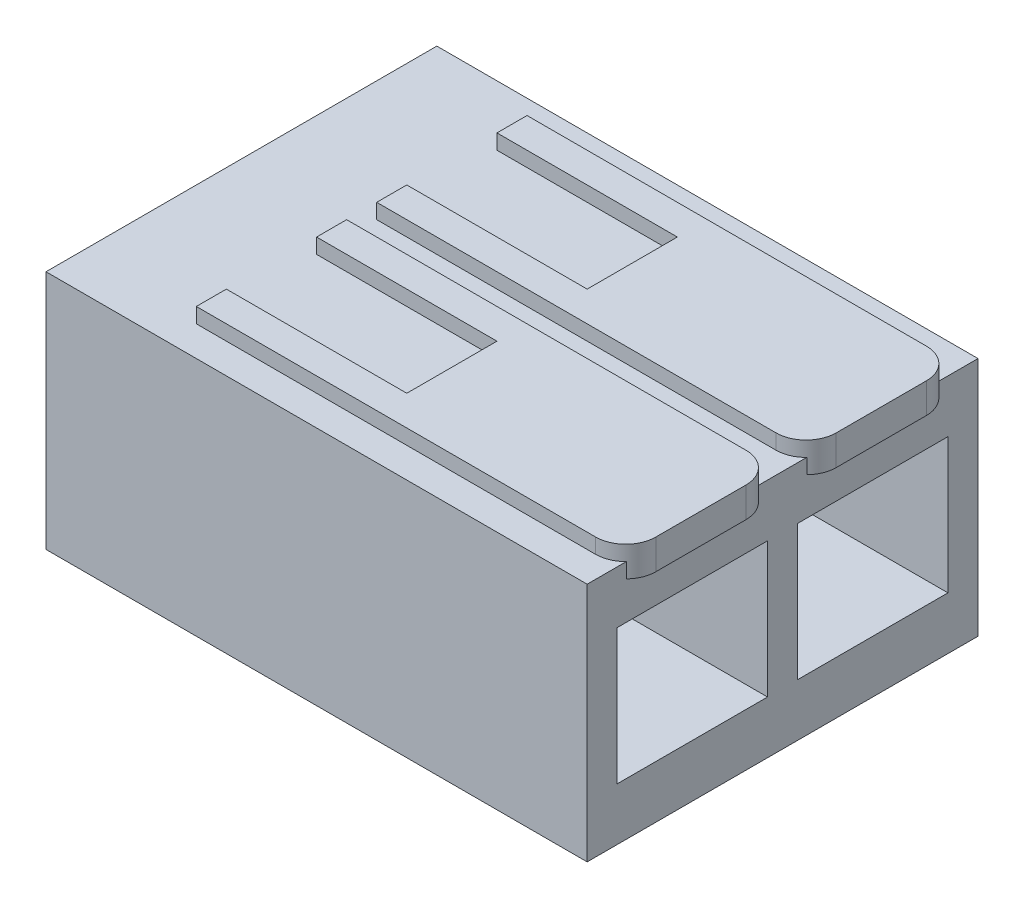
ISO-10303-21;
HEADER;
FILE_DESCRIPTION(('STEP AP214'),'2;1');
FILE_NAME('part.step','',(''),(''),'','','');
FILE_SCHEMA(('AUTOMOTIVE_DESIGN { 1 0 10303 214 1 1 1 1 }'));
ENDSEC;
DATA;
#1=APPLICATION_CONTEXT('core data for automotive mechanical design processes');
#2=APPLICATION_PROTOCOL_DEFINITION('international standard','automotive_design',2000,#1);
#3=PRODUCT_CONTEXT('',#1,'mechanical');
#4=PRODUCT('Part','Part','',(#3));
#5=PRODUCT_RELATED_PRODUCT_CATEGORY('part','',(#4));
#6=PRODUCT_DEFINITION_FORMATION('','',#4);
#7=PRODUCT_DEFINITION_CONTEXT('part definition',#1,'design');
#8=PRODUCT_DEFINITION('design','',#6,#7);
#9=PRODUCT_DEFINITION_SHAPE('','',#8);
#10=(LENGTH_UNIT() NAMED_UNIT(*) SI_UNIT(.MILLI.,.METRE.));
#11=(NAMED_UNIT(*) PLANE_ANGLE_UNIT() SI_UNIT($,.RADIAN.));
#12=(NAMED_UNIT(*) SI_UNIT($,.STERADIAN.) SOLID_ANGLE_UNIT());
#13=UNCERTAINTY_MEASURE_WITH_UNIT(LENGTH_MEASURE(1.E-05),#10,'distance_accuracy_value','');
#14=(GEOMETRIC_REPRESENTATION_CONTEXT(3) GLOBAL_UNCERTAINTY_ASSIGNED_CONTEXT((#13)) GLOBAL_UNIT_ASSIGNED_CONTEXT((#10,
#11,#12)) REPRESENTATION_CONTEXT('',''));
#15=CARTESIAN_POINT('',(0.,0.,0.));
#16=DIRECTION('',(0.,0.,1.));
#17=DIRECTION('',(1.,0.,0.));
#18=AXIS2_PLACEMENT_3D('',#15,#16,#17);
#19=CARTESIAN_POINT('',(4.,8.5,7.));
#20=DIRECTION('',(1.,0.,0.));
#21=DIRECTION('',(0.,1.,0.));
#22=AXIS2_PLACEMENT_3D('',#19,#20,#21);
#23=PLANE('',#22);
#24=DIRECTION('',(0.,0.,1.));
#25=VECTOR('',#24,1.);
#26=CARTESIAN_POINT('',(4.,7.5,7.));
#27=LINE('',#26,#25);
#28=CARTESIAN_POINT('',(4.,7.5,7.));
#29=VERTEX_POINT('',#28);
#30=CARTESIAN_POINT('',(4.,7.5,8.));
#31=VERTEX_POINT('',#30);
#32=EDGE_CURVE('E157',#29,#31,#27,.T.);
#33=ORIENTED_EDGE('',*,*,#32,.T.);
#34=DIRECTION('',(0.,-1.,0.));
#35=VECTOR('',#34,1.);
#36=CARTESIAN_POINT('',(4.,8.5,8.));
#37=LINE('',#36,#35);
#38=CARTESIAN_POINT('',(4.,8.5,8.));
#39=VERTEX_POINT('',#38);
#40=EDGE_CURVE('E12',#39,#31,#37,.T.);
#41=ORIENTED_EDGE('',*,*,#40,.F.);
#42=DIRECTION('',(0.,0.,1.));
#43=VECTOR('',#42,1.);
#44=CARTESIAN_POINT('',(4.,8.5,7.));
#45=LINE('',#44,#43);
#46=CARTESIAN_POINT('',(4.,8.5,7.));
#47=VERTEX_POINT('',#46);
#48=EDGE_CURVE('E175',#47,#39,#45,.T.);
#49=ORIENTED_EDGE('',*,*,#48,.F.);
#50=DIRECTION('',(0.,-1.,0.));
#51=VECTOR('',#50,1.);
#52=CARTESIAN_POINT('',(4.,8.5,7.));
#53=LINE('',#52,#51);
#54=EDGE_CURVE('E153',#47,#29,#53,.T.);
#55=ORIENTED_EDGE('',*,*,#54,.T.);
#56=EDGE_LOOP('',(#33,#41,#49,#55));
#57=FACE_BOUND('',#56,.T.);
#58=ADVANCED_FACE('F49',(#57),#23,.F.);
#59=CARTESIAN_POINT('',(4.,8.5,8.));
#60=DIRECTION('',(0.,0.,-1.));
#61=DIRECTION('',(-1.,0.,0.));
#62=AXIS2_PLACEMENT_3D('',#59,#60,#61);
#63=PLANE('',#62);
#64=DIRECTION('',(1.,0.,0.));
#65=VECTOR('',#64,1.);
#66=CARTESIAN_POINT('',(4.,7.5,8.));
#67=LINE('',#66,#65);
#68=CARTESIAN_POINT('',(10.,7.5,8.));
#69=VERTEX_POINT('',#68);
#70=EDGE_CURVE('E160',#31,#69,#67,.T.);
#71=ORIENTED_EDGE('',*,*,#70,.T.);
#72=DIRECTION('',(0.,-1.,0.));
#73=VECTOR('',#72,1.);
#74=CARTESIAN_POINT('',(10.,8.5,8.));
#75=LINE('',#74,#73);
#76=CARTESIAN_POINT('',(10.,8.5,8.));
#77=VERTEX_POINT('',#76);
#78=EDGE_CURVE('E57',#77,#69,#75,.T.);
#79=ORIENTED_EDGE('',*,*,#78,.F.);
#80=DIRECTION('',(1.,0.,0.));
#81=VECTOR('',#80,1.);
#82=CARTESIAN_POINT('',(4.,8.5,8.));
#83=LINE('',#82,#81);
#84=EDGE_CURVE('E114',#39,#77,#83,.T.);
#85=ORIENTED_EDGE('',*,*,#84,.F.);
#86=ORIENTED_EDGE('',*,*,#40,.T.);
#87=EDGE_LOOP('',(#71,#79,#85,#86));
#88=FACE_BOUND('',#87,.T.);
#89=ADVANCED_FACE('F224',(#88),#63,.F.);
#90=CARTESIAN_POINT('',(10.,8.5,8.));
#91=DIRECTION('',(1.,0.,0.));
#92=DIRECTION('',(0.,1.,0.));
#93=AXIS2_PLACEMENT_3D('',#90,#91,#92);
#94=PLANE('',#93);
#95=DIRECTION('',(0.,0.,1.));
#96=VECTOR('',#95,1.);
#97=CARTESIAN_POINT('',(10.,7.5,8.));
#98=LINE('',#97,#96);
#99=CARTESIAN_POINT('',(10.,7.5,11.));
#100=VERTEX_POINT('',#99);
#101=EDGE_CURVE('E162',#69,#100,#98,.T.);
#102=ORIENTED_EDGE('',*,*,#101,.T.);
#103=DIRECTION('',(0.,-1.,0.));
#104=VECTOR('',#103,1.);
#105=CARTESIAN_POINT('',(10.,8.5,11.));
#106=LINE('',#105,#104);
#107=CARTESIAN_POINT('',(10.,8.5,11.));
#108=VERTEX_POINT('',#107);
#109=EDGE_CURVE('E188',#108,#100,#106,.T.);
#110=ORIENTED_EDGE('',*,*,#109,.F.);
#111=DIRECTION('',(0.,0.,1.));
#112=VECTOR('',#111,1.);
#113=CARTESIAN_POINT('',(10.,8.5,8.));
#114=LINE('',#113,#112);
#115=EDGE_CURVE('E196',#77,#108,#114,.T.);
#116=ORIENTED_EDGE('',*,*,#115,.F.);
#117=ORIENTED_EDGE('',*,*,#78,.T.);
#118=EDGE_LOOP('',(#102,#110,#116,#117));
#119=FACE_BOUND('',#118,.T.);
#120=ADVANCED_FACE('F194',(#119),#94,.F.);
#121=CARTESIAN_POINT('',(10.,8.5,11.));
#122=DIRECTION('',(0.,0.,1.));
#123=DIRECTION('',(1.,0.,0.));
#124=AXIS2_PLACEMENT_3D('',#121,#122,#123);
#125=PLANE('',#124);
#126=DIRECTION('',(-1.,0.,0.));
#127=VECTOR('',#126,1.);
#128=CARTESIAN_POINT('',(10.,7.5,11.));
#129=LINE('',#128,#127);
#130=CARTESIAN_POINT('',(4.,7.5,11.));
#131=VERTEX_POINT('',#130);
#132=EDGE_CURVE('E164',#100,#131,#129,.T.);
#133=ORIENTED_EDGE('',*,*,#132,.T.);
#134=DIRECTION('',(0.,-1.,0.));
#135=VECTOR('',#134,1.);
#136=CARTESIAN_POINT('',(4.,8.5,11.));
#137=LINE('',#136,#135);
#138=CARTESIAN_POINT('',(4.,8.5,11.));
#139=VERTEX_POINT('',#138);
#140=EDGE_CURVE('E185',#139,#131,#137,.T.);
#141=ORIENTED_EDGE('',*,*,#140,.F.);
#142=DIRECTION('',(-1.,0.,0.));
#143=VECTOR('',#142,1.);
#144=CARTESIAN_POINT('',(10.,8.5,11.));
#145=LINE('',#144,#143);
#146=EDGE_CURVE('E214',#108,#139,#145,.T.);
#147=ORIENTED_EDGE('',*,*,#146,.F.);
#148=ORIENTED_EDGE('',*,*,#109,.T.);
#149=EDGE_LOOP('',(#133,#141,#147,#148));
#150=FACE_BOUND('',#149,.T.);
#151=ADVANCED_FACE('F205',(#150),#125,.F.);
#152=CARTESIAN_POINT('',(4.,8.5,11.));
#153=DIRECTION('',(1.,0.,0.));
#154=DIRECTION('',(0.,1.,0.));
#155=AXIS2_PLACEMENT_3D('',#152,#153,#154);
#156=PLANE('',#155);
#157=DIRECTION('',(0.,0.,1.));
#158=VECTOR('',#157,1.);
#159=CARTESIAN_POINT('',(4.,7.5,11.));
#160=LINE('',#159,#158);
#161=CARTESIAN_POINT('',(4.,7.5,12.));
#162=VERTEX_POINT('',#161);
#163=EDGE_CURVE('E166',#131,#162,#160,.T.);
#164=ORIENTED_EDGE('',*,*,#163,.T.);
#165=DIRECTION('',(0.,-1.,0.));
#166=VECTOR('',#165,1.);
#167=CARTESIAN_POINT('',(4.,8.5,12.));
#168=LINE('',#167,#166);
#169=CARTESIAN_POINT('',(4.,8.5,12.));
#170=VERTEX_POINT('',#169);
#171=EDGE_CURVE('E182',#170,#162,#168,.T.);
#172=ORIENTED_EDGE('',*,*,#171,.F.);
#173=DIRECTION('',(0.,0.,1.));
#174=VECTOR('',#173,1.);
#175=CARTESIAN_POINT('',(4.,8.5,11.));
#176=LINE('',#175,#174);
#177=EDGE_CURVE('E211',#139,#170,#176,.T.);
#178=ORIENTED_EDGE('',*,*,#177,.F.);
#179=ORIENTED_EDGE('',*,*,#140,.T.);
#180=EDGE_LOOP('',(#164,#172,#178,#179));
#181=FACE_BOUND('',#180,.T.);
#182=ADVANCED_FACE('F209',(#181),#156,.F.);
#183=CARTESIAN_POINT('',(4.,8.5,12.));
#184=DIRECTION('',(0.,0.,-1.));
#185=DIRECTION('',(-1.,0.,0.));
#186=AXIS2_PLACEMENT_3D('',#183,#184,#185);
#187=PLANE('',#186);
#188=DIRECTION('',(1.,0.,0.));
#189=VECTOR('',#188,1.);
#190=CARTESIAN_POINT('',(4.,7.5,12.));
#191=LINE('',#190,#189);
#192=CARTESIAN_POINT('',(17.2832005913522,7.5,12.));
#193=VERTEX_POINT('',#192);
#194=EDGE_CURVE('E168',#162,#193,#191,.T.);
#195=ORIENTED_EDGE('',*,*,#194,.T.);
#196=DIRECTION('',(0.,-1.,0.));
#197=VECTOR('',#196,1.);
#198=CARTESIAN_POINT('',(17.2832005913522,8.5,12.));
#199=LINE('',#198,#197);
#200=CARTESIAN_POINT('',(17.2832005913522,8.5,12.));
#201=VERTEX_POINT('',#200);
#202=EDGE_CURVE('E179',#201,#193,#199,.T.);
#203=ORIENTED_EDGE('',*,*,#202,.F.);
#204=DIRECTION('',(1.,0.,0.));
#205=VECTOR('',#204,1.);
#206=CARTESIAN_POINT('',(4.,8.5,12.));
#207=LINE('',#206,#205);
#208=EDGE_CURVE('E213',#170,#201,#207,.T.);
#209=ORIENTED_EDGE('',*,*,#208,.F.);
#210=ORIENTED_EDGE('',*,*,#171,.T.);
#211=EDGE_LOOP('',(#195,#203,#209,#210));
#212=FACE_BOUND('',#211,.T.);
#213=ADVANCED_FACE('F236',(#212),#187,.F.);
#214=CARTESIAN_POINT('',(17.2832005913522,8.5,11.));
#215=DIRECTION('',(0.,-1.,0.));
#216=DIRECTION('',(1.,0.,0.));
#217=AXIS2_PLACEMENT_3D('',#214,#215,#216);
#218=CYLINDRICAL_SURFACE('',#217,1.);
#219=CARTESIAN_POINT('',(17.2832005913522,7.5,11.));
#220=DIRECTION('',(0.,1.,0.));
#221=DIRECTION('',(-1.,0.,0.));
#222=AXIS2_PLACEMENT_3D('',#219,#220,#221);
#223=CIRCLE('',#222,1.);
#224=CARTESIAN_POINT('',(18.2832005913522,7.5,11.));
#225=VERTEX_POINT('',#224);
#226=EDGE_CURVE('E170',#193,#225,#223,.T.);
#227=ORIENTED_EDGE('',*,*,#226,.T.);
#228=DIRECTION('',(0.,-1.,0.));
#229=VECTOR('',#228,1.);
#230=CARTESIAN_POINT('',(18.2832005913522,8.5,11.));
#231=LINE('',#230,#229);
#232=CARTESIAN_POINT('',(18.2832005913522,8.5,11.));
#233=VERTEX_POINT('',#232);
#234=EDGE_CURVE('E148',#233,#225,#231,.T.);
#235=ORIENTED_EDGE('',*,*,#234,.F.);
#236=CARTESIAN_POINT('',(17.2832005913522,8.5,11.));
#237=DIRECTION('',(0.,1.,0.));
#238=DIRECTION('',(-1.,0.,0.));
#239=AXIS2_PLACEMENT_3D('',#236,#237,#238);
#240=CIRCLE('',#239,1.);
#241=EDGE_CURVE('E139',#201,#233,#240,.T.);
#242=ORIENTED_EDGE('',*,*,#241,.F.);
#243=ORIENTED_EDGE('',*,*,#202,.T.);
#244=EDGE_LOOP('',(#227,#235,#242,#243));
#245=FACE_BOUND('',#244,.T.);
#246=ADVANCED_FACE('F239',(#245),#218,.T.);
#247=CARTESIAN_POINT('',(18.2832005913522,8.5,8.));
#248=DIRECTION('',(-1.,0.,0.));
#249=DIRECTION('',(0.,0.,1.));
#250=AXIS2_PLACEMENT_3D('',#247,#248,#249);
#251=PLANE('',#250);
#252=DIRECTION('',(0.,0.,-1.));
#253=VECTOR('',#252,1.);
#254=CARTESIAN_POINT('',(18.2832005913522,7.5,8.));
#255=LINE('',#254,#253);
#256=CARTESIAN_POINT('',(18.2832005913522,7.5,8.));
#257=VERTEX_POINT('',#256);
#258=EDGE_CURVE('E147',#225,#257,#255,.T.);
#259=ORIENTED_EDGE('',*,*,#258,.T.);
#260=DIRECTION('',(0.,-1.,0.));
#261=VECTOR('',#260,1.);
#262=CARTESIAN_POINT('',(18.2832005913522,8.5,8.));
#263=LINE('',#262,#261);
#264=CARTESIAN_POINT('',(18.2832005913522,8.5,8.));
#265=VERTEX_POINT('',#264);
#266=EDGE_CURVE('E144',#265,#257,#263,.T.);
#267=ORIENTED_EDGE('',*,*,#266,.F.);
#268=DIRECTION('',(0.,0.,-1.));
#269=VECTOR('',#268,1.);
#270=CARTESIAN_POINT('',(18.2832005913522,8.5,8.));
#271=LINE('',#270,#269);
#272=EDGE_CURVE('E133',#233,#265,#271,.T.);
#273=ORIENTED_EDGE('',*,*,#272,.F.);
#274=ORIENTED_EDGE('',*,*,#234,.T.);
#275=EDGE_LOOP('',(#259,#267,#273,#274));
#276=FACE_BOUND('',#275,.T.);
#277=ADVANCED_FACE('F145',(#276),#251,.F.);
#278=CARTESIAN_POINT('',(17.2832005913522,8.5,8.));
#279=DIRECTION('',(0.,-1.,0.));
#280=DIRECTION('',(1.,0.,0.));
#281=AXIS2_PLACEMENT_3D('',#278,#279,#280);
#282=CYLINDRICAL_SURFACE('',#281,0.999999999999999);
#283=CARTESIAN_POINT('',(17.2832005913522,7.5,8.));
#284=DIRECTION('',(0.,1.,0.));
#285=DIRECTION('',(1.,0.,0.));
#286=AXIS2_PLACEMENT_3D('',#283,#284,#285);
#287=CIRCLE('',#286,0.999999999999999);
#288=CARTESIAN_POINT('',(17.2832005913522,7.5,7.));
#289=VERTEX_POINT('',#288);
#290=EDGE_CURVE('E100',#257,#289,#287,.T.);
#291=ORIENTED_EDGE('',*,*,#290,.T.);
#292=DIRECTION('',(0.,-1.,0.));
#293=VECTOR('',#292,1.);
#294=CARTESIAN_POINT('',(17.2832005913522,8.5,7.));
#295=LINE('',#294,#293);
#296=CARTESIAN_POINT('',(17.2832005913522,8.5,7.));
#297=VERTEX_POINT('',#296);
#298=EDGE_CURVE('E149',#297,#289,#295,.T.);
#299=ORIENTED_EDGE('',*,*,#298,.F.);
#300=CARTESIAN_POINT('',(17.2832005913522,8.5,8.));
#301=DIRECTION('',(0.,1.,0.));
#302=DIRECTION('',(1.,0.,0.));
#303=AXIS2_PLACEMENT_3D('',#300,#301,#302);
#304=CIRCLE('',#303,0.999999999999999);
#305=EDGE_CURVE('E137',#265,#297,#304,.T.);
#306=ORIENTED_EDGE('',*,*,#305,.F.);
#307=ORIENTED_EDGE('',*,*,#266,.T.);
#308=EDGE_LOOP('',(#291,#299,#306,#307));
#309=FACE_BOUND('',#308,.T.);
#310=ADVANCED_FACE('F151',(#309),#282,.T.);
#311=CARTESIAN_POINT('',(4.,8.5,7.));
#312=DIRECTION('',(0.,0.,1.));
#313=DIRECTION('',(1.,0.,0.));
#314=AXIS2_PLACEMENT_3D('',#311,#312,#313);
#315=PLANE('',#314);
#316=DIRECTION('',(-1.,0.,0.));
#317=VECTOR('',#316,1.);
#318=CARTESIAN_POINT('',(4.,7.5,7.));
#319=LINE('',#318,#317);
#320=EDGE_CURVE('E106',#289,#29,#319,.T.);
#321=ORIENTED_EDGE('',*,*,#320,.T.);
#322=ORIENTED_EDGE('',*,*,#54,.F.);
#323=DIRECTION('',(-1.,0.,0.));
#324=VECTOR('',#323,1.);
#325=CARTESIAN_POINT('',(4.,8.5,7.));
#326=LINE('',#325,#324);
#327=EDGE_CURVE('E65',#297,#47,#326,.T.);
#328=ORIENTED_EDGE('',*,*,#327,.F.);
#329=ORIENTED_EDGE('',*,*,#298,.T.);
#330=EDGE_LOOP('',(#321,#322,#328,#329));
#331=FACE_BOUND('',#330,.T.);
#332=ADVANCED_FACE('F248',(#331),#315,.F.);
#333=CARTESIAN_POINT('',(17.2832005913522,8.5,11.));
#334=DIRECTION('',(0.,1.,0.));
#335=DIRECTION('',(-1.,0.,0.));
#336=AXIS2_PLACEMENT_3D('',#333,#334,#335);
#337=PLANE('',#336);
#338=ORIENTED_EDGE('',*,*,#48,.T.);
#339=ORIENTED_EDGE('',*,*,#84,.T.);
#340=ORIENTED_EDGE('',*,*,#115,.T.);
#341=ORIENTED_EDGE('',*,*,#146,.T.);
#342=ORIENTED_EDGE('',*,*,#177,.T.);
#343=ORIENTED_EDGE('',*,*,#208,.T.);
#344=ORIENTED_EDGE('',*,*,#241,.T.);
#345=ORIENTED_EDGE('',*,*,#272,.T.);
#346=ORIENTED_EDGE('',*,*,#305,.T.);
#347=ORIENTED_EDGE('',*,*,#327,.T.);
#348=EDGE_LOOP('',(#338,#339,#340,#341,#342,#343,#344,#345,#346,#347));
#349=FACE_BOUND('',#348,.T.);
#350=ADVANCED_FACE('F135',(#349),#337,.T.);
#351=CARTESIAN_POINT('',(17.2832005913522,7.5,11.));
#352=DIRECTION('',(0.,1.,0.));
#353=DIRECTION('',(-1.,0.,0.));
#354=AXIS2_PLACEMENT_3D('',#351,#352,#353);
#355=PLANE('',#354);
#356=ORIENTED_EDGE('',*,*,#32,.F.);
#357=ORIENTED_EDGE('',*,*,#320,.F.);
#358=ORIENTED_EDGE('',*,*,#290,.F.);
#359=ORIENTED_EDGE('',*,*,#258,.F.);
#360=ORIENTED_EDGE('',*,*,#226,.F.);
#361=ORIENTED_EDGE('',*,*,#194,.F.);
#362=ORIENTED_EDGE('',*,*,#163,.F.);
#363=ORIENTED_EDGE('',*,*,#132,.F.);
#364=ORIENTED_EDGE('',*,*,#101,.F.);
#365=ORIENTED_EDGE('',*,*,#70,.F.);
#366=EDGE_LOOP('',(#356,#357,#358,#359,#360,#361,#362,#363,#364,#365));
#367=FACE_BOUND('',#366,.T.);
#368=ADVANCED_FACE('F200',(#367),#355,.F.);
#369=CLOSED_SHELL('',(#58,#89,#120,#151,#182,#213,#246,#277,#310,#332,#350,#368));
#370=MANIFOLD_SOLID_BREP('B2',#369);
#371=CARTESIAN_POINT('',(4.,8.5,1.));
#372=DIRECTION('',(1.,0.,0.));
#373=DIRECTION('',(0.,1.,0.));
#374=AXIS2_PLACEMENT_3D('',#371,#372,#373);
#375=PLANE('',#374);
#376=DIRECTION('',(0.,0.,1.));
#377=VECTOR('',#376,1.);
#378=CARTESIAN_POINT('',(4.,7.5,1.));
#379=LINE('',#378,#377);
#380=CARTESIAN_POINT('',(4.,7.5,1.));
#381=VERTEX_POINT('',#380);
#382=CARTESIAN_POINT('',(4.,7.5,2.));
#383=VERTEX_POINT('',#382);
#384=EDGE_CURVE('E445',#381,#383,#379,.T.);
#385=ORIENTED_EDGE('',*,*,#384,.T.);
#386=DIRECTION('',(0.,-1.,0.));
#387=VECTOR('',#386,1.);
#388=CARTESIAN_POINT('',(4.,8.5,2.));
#389=LINE('',#388,#387);
#390=CARTESIAN_POINT('',(4.,8.5,2.));
#391=VERTEX_POINT('',#390);
#392=EDGE_CURVE('E47',#391,#383,#389,.T.);
#393=ORIENTED_EDGE('',*,*,#392,.F.);
#394=DIRECTION('',(0.,0.,1.));
#395=VECTOR('',#394,1.);
#396=CARTESIAN_POINT('',(4.,8.5,1.));
#397=LINE('',#396,#395);
#398=CARTESIAN_POINT('',(4.,8.5,1.));
#399=VERTEX_POINT('',#398);
#400=EDGE_CURVE('E463',#399,#391,#397,.T.);
#401=ORIENTED_EDGE('',*,*,#400,.F.);
#402=DIRECTION('',(0.,-1.,0.));
#403=VECTOR('',#402,1.);
#404=CARTESIAN_POINT('',(4.,8.5,1.));
#405=LINE('',#404,#403);
#406=EDGE_CURVE('E441',#399,#381,#405,.T.);
#407=ORIENTED_EDGE('',*,*,#406,.T.);
#408=EDGE_LOOP('',(#385,#393,#401,#407));
#409=FACE_BOUND('',#408,.T.);
#410=ADVANCED_FACE('F337',(#409),#375,.F.);
#411=CARTESIAN_POINT('',(4.,8.5,2.));
#412=DIRECTION('',(0.,0.,-1.));
#413=DIRECTION('',(-1.,0.,0.));
#414=AXIS2_PLACEMENT_3D('',#411,#412,#413);
#415=PLANE('',#414);
#416=DIRECTION('',(1.,0.,0.));
#417=VECTOR('',#416,1.);
#418=CARTESIAN_POINT('',(4.,7.5,2.));
#419=LINE('',#418,#417);
#420=CARTESIAN_POINT('',(10.,7.5,2.));
#421=VERTEX_POINT('',#420);
#422=EDGE_CURVE('E448',#383,#421,#419,.T.);
#423=ORIENTED_EDGE('',*,*,#422,.T.);
#424=DIRECTION('',(0.,-1.,0.));
#425=VECTOR('',#424,1.);
#426=CARTESIAN_POINT('',(10.,8.5,2.));
#427=LINE('',#426,#425);
#428=CARTESIAN_POINT('',(10.,8.5,2.));
#429=VERTEX_POINT('',#428);
#430=EDGE_CURVE('E345',#429,#421,#427,.T.);
#431=ORIENTED_EDGE('',*,*,#430,.F.);
#432=DIRECTION('',(1.,0.,0.));
#433=VECTOR('',#432,1.);
#434=CARTESIAN_POINT('',(4.,8.5,2.));
#435=LINE('',#434,#433);
#436=EDGE_CURVE('E402',#391,#429,#435,.T.);
#437=ORIENTED_EDGE('',*,*,#436,.F.);
#438=ORIENTED_EDGE('',*,*,#392,.T.);
#439=EDGE_LOOP('',(#423,#431,#437,#438));
#440=FACE_BOUND('',#439,.T.);
#441=ADVANCED_FACE('F512',(#440),#415,.F.);
#442=CARTESIAN_POINT('',(10.,8.5,2.));
#443=DIRECTION('',(1.,0.,0.));
#444=DIRECTION('',(0.,0.,-1.));
#445=AXIS2_PLACEMENT_3D('',#442,#443,#444);
#446=PLANE('',#445);
#447=DIRECTION('',(0.,0.,1.));
#448=VECTOR('',#447,1.);
#449=CARTESIAN_POINT('',(10.,7.5,2.));
#450=LINE('',#449,#448);
#451=CARTESIAN_POINT('',(10.,7.5,5.));
#452=VERTEX_POINT('',#451);
#453=EDGE_CURVE('E450',#421,#452,#450,.T.);
#454=ORIENTED_EDGE('',*,*,#453,.T.);
#455=DIRECTION('',(0.,-1.,0.));
#456=VECTOR('',#455,1.);
#457=CARTESIAN_POINT('',(10.,8.5,5.));
#458=LINE('',#457,#456);
#459=CARTESIAN_POINT('',(10.,8.5,5.));
#460=VERTEX_POINT('',#459);
#461=EDGE_CURVE('E476',#460,#452,#458,.T.);
#462=ORIENTED_EDGE('',*,*,#461,.F.);
#463=DIRECTION('',(0.,0.,1.));
#464=VECTOR('',#463,1.);
#465=CARTESIAN_POINT('',(10.,8.5,2.));
#466=LINE('',#465,#464);
#467=EDGE_CURVE('E484',#429,#460,#466,.T.);
#468=ORIENTED_EDGE('',*,*,#467,.F.);
#469=ORIENTED_EDGE('',*,*,#430,.T.);
#470=EDGE_LOOP('',(#454,#462,#468,#469));
#471=FACE_BOUND('',#470,.T.);
#472=ADVANCED_FACE('F482',(#471),#446,.F.);
#473=CARTESIAN_POINT('',(10.,8.5,5.));
#474=DIRECTION('',(0.,0.,1.));
#475=DIRECTION('',(1.,0.,0.));
#476=AXIS2_PLACEMENT_3D('',#473,#474,#475);
#477=PLANE('',#476);
#478=DIRECTION('',(-1.,0.,0.));
#479=VECTOR('',#478,1.);
#480=CARTESIAN_POINT('',(10.,7.5,5.));
#481=LINE('',#480,#479);
#482=CARTESIAN_POINT('',(4.,7.5,5.));
#483=VERTEX_POINT('',#482);
#484=EDGE_CURVE('E452',#452,#483,#481,.T.);
#485=ORIENTED_EDGE('',*,*,#484,.T.);
#486=DIRECTION('',(0.,-1.,0.));
#487=VECTOR('',#486,1.);
#488=CARTESIAN_POINT('',(4.,8.5,5.));
#489=LINE('',#488,#487);
#490=CARTESIAN_POINT('',(4.,8.5,5.));
#491=VERTEX_POINT('',#490);
#492=EDGE_CURVE('E473',#491,#483,#489,.T.);
#493=ORIENTED_EDGE('',*,*,#492,.F.);
#494=DIRECTION('',(-1.,0.,0.));
#495=VECTOR('',#494,1.);
#496=CARTESIAN_POINT('',(10.,8.5,5.));
#497=LINE('',#496,#495);
#498=EDGE_CURVE('E502',#460,#491,#497,.T.);
#499=ORIENTED_EDGE('',*,*,#498,.F.);
#500=ORIENTED_EDGE('',*,*,#461,.T.);
#501=EDGE_LOOP('',(#485,#493,#499,#500));
#502=FACE_BOUND('',#501,.T.);
#503=ADVANCED_FACE('F493',(#502),#477,.F.);
#504=CARTESIAN_POINT('',(4.,8.5,5.));
#505=DIRECTION('',(1.,0.,0.));
#506=DIRECTION('',(0.,0.,-1.));
#507=AXIS2_PLACEMENT_3D('',#504,#505,#506);
#508=PLANE('',#507);
#509=DIRECTION('',(0.,0.,1.));
#510=VECTOR('',#509,1.);
#511=CARTESIAN_POINT('',(4.,7.5,5.));
#512=LINE('',#511,#510);
#513=CARTESIAN_POINT('',(4.,7.5,6.));
#514=VERTEX_POINT('',#513);
#515=EDGE_CURVE('E454',#483,#514,#512,.T.);
#516=ORIENTED_EDGE('',*,*,#515,.T.);
#517=DIRECTION('',(0.,-1.,0.));
#518=VECTOR('',#517,1.);
#519=CARTESIAN_POINT('',(4.,8.5,6.));
#520=LINE('',#519,#518);
#521=CARTESIAN_POINT('',(4.,8.5,6.));
#522=VERTEX_POINT('',#521);
#523=EDGE_CURVE('E470',#522,#514,#520,.T.);
#524=ORIENTED_EDGE('',*,*,#523,.F.);
#525=DIRECTION('',(0.,0.,1.));
#526=VECTOR('',#525,1.);
#527=CARTESIAN_POINT('',(4.,8.5,5.));
#528=LINE('',#527,#526);
#529=EDGE_CURVE('E499',#491,#522,#528,.T.);
#530=ORIENTED_EDGE('',*,*,#529,.F.);
#531=ORIENTED_EDGE('',*,*,#492,.T.);
#532=EDGE_LOOP('',(#516,#524,#530,#531));
#533=FACE_BOUND('',#532,.T.);
#534=ADVANCED_FACE('F497',(#533),#508,.F.);
#535=CARTESIAN_POINT('',(4.,8.5,6.));
#536=DIRECTION('',(0.,0.,-1.));
#537=DIRECTION('',(-1.,0.,0.));
#538=AXIS2_PLACEMENT_3D('',#535,#536,#537);
#539=PLANE('',#538);
#540=DIRECTION('',(1.,0.,0.));
#541=VECTOR('',#540,1.);
#542=CARTESIAN_POINT('',(4.,7.5,6.));
#543=LINE('',#542,#541);
#544=CARTESIAN_POINT('',(17.2832005913522,7.5,6.));
#545=VERTEX_POINT('',#544);
#546=EDGE_CURVE('E456',#514,#545,#543,.T.);
#547=ORIENTED_EDGE('',*,*,#546,.T.);
#548=DIRECTION('',(0.,-1.,0.));
#549=VECTOR('',#548,1.);
#550=CARTESIAN_POINT('',(17.2832005913522,8.5,6.));
#551=LINE('',#550,#549);
#552=CARTESIAN_POINT('',(17.2832005913522,8.5,6.));
#553=VERTEX_POINT('',#552);
#554=EDGE_CURVE('E467',#553,#545,#551,.T.);
#555=ORIENTED_EDGE('',*,*,#554,.F.);
#556=DIRECTION('',(1.,0.,0.));
#557=VECTOR('',#556,1.);
#558=CARTESIAN_POINT('',(4.,8.5,6.));
#559=LINE('',#558,#557);
#560=EDGE_CURVE('E501',#522,#553,#559,.T.);
#561=ORIENTED_EDGE('',*,*,#560,.F.);
#562=ORIENTED_EDGE('',*,*,#523,.T.);
#563=EDGE_LOOP('',(#547,#555,#561,#562));
#564=FACE_BOUND('',#563,.T.);
#565=ADVANCED_FACE('F524',(#564),#539,.F.);
#566=CARTESIAN_POINT('',(17.2832005913522,8.5,5.));
#567=DIRECTION('',(0.,-1.,0.));
#568=DIRECTION('',(1.,0.,0.));
#569=AXIS2_PLACEMENT_3D('',#566,#567,#568);
#570=CYLINDRICAL_SURFACE('',#569,0.999999999999998);
#571=CARTESIAN_POINT('',(17.2832005913522,7.5,5.));
#572=DIRECTION('',(0.,1.,0.));
#573=DIRECTION('',(-1.,0.,0.));
#574=AXIS2_PLACEMENT_3D('',#571,#572,#573);
#575=CIRCLE('',#574,0.999999999999998);
#576=CARTESIAN_POINT('',(18.2832005913522,7.5,5.));
#577=VERTEX_POINT('',#576);
#578=EDGE_CURVE('E458',#545,#577,#575,.T.);
#579=ORIENTED_EDGE('',*,*,#578,.T.);
#580=DIRECTION('',(0.,-1.,0.));
#581=VECTOR('',#580,1.);
#582=CARTESIAN_POINT('',(18.2832005913522,8.5,5.));
#583=LINE('',#582,#581);
#584=CARTESIAN_POINT('',(18.2832005913522,8.5,5.));
#585=VERTEX_POINT('',#584);
#586=EDGE_CURVE('E436',#585,#577,#583,.T.);
#587=ORIENTED_EDGE('',*,*,#586,.F.);
#588=CARTESIAN_POINT('',(17.2832005913522,8.5,5.));
#589=DIRECTION('',(0.,1.,0.));
#590=DIRECTION('',(-1.,0.,0.));
#591=AXIS2_PLACEMENT_3D('',#588,#589,#590);
#592=CIRCLE('',#591,0.999999999999998);
#593=EDGE_CURVE('E427',#553,#585,#592,.T.);
#594=ORIENTED_EDGE('',*,*,#593,.F.);
#595=ORIENTED_EDGE('',*,*,#554,.T.);
#596=EDGE_LOOP('',(#579,#587,#594,#595));
#597=FACE_BOUND('',#596,.T.);
#598=ADVANCED_FACE('F527',(#597),#570,.T.);
#599=CARTESIAN_POINT('',(18.2832005913522,8.5,2.));
#600=DIRECTION('',(-1.,0.,0.));
#601=DIRECTION('',(0.,-1.,0.));
#602=AXIS2_PLACEMENT_3D('',#599,#600,#601);
#603=PLANE('',#602);
#604=DIRECTION('',(0.,0.,-1.));
#605=VECTOR('',#604,1.);
#606=CARTESIAN_POINT('',(18.2832005913522,7.5,2.));
#607=LINE('',#606,#605);
#608=CARTESIAN_POINT('',(18.2832005913522,7.5,2.));
#609=VERTEX_POINT('',#608);
#610=EDGE_CURVE('E435',#577,#609,#607,.T.);
#611=ORIENTED_EDGE('',*,*,#610,.T.);
#612=DIRECTION('',(0.,-1.,0.));
#613=VECTOR('',#612,1.);
#614=CARTESIAN_POINT('',(18.2832005913522,8.5,2.));
#615=LINE('',#614,#613);
#616=CARTESIAN_POINT('',(18.2832005913522,8.5,2.));
#617=VERTEX_POINT('',#616);
#618=EDGE_CURVE('E432',#617,#609,#615,.T.);
#619=ORIENTED_EDGE('',*,*,#618,.F.);
#620=DIRECTION('',(0.,0.,-1.));
#621=VECTOR('',#620,1.);
#622=CARTESIAN_POINT('',(18.2832005913522,8.5,2.));
#623=LINE('',#622,#621);
#624=EDGE_CURVE('E421',#585,#617,#623,.T.);
#625=ORIENTED_EDGE('',*,*,#624,.F.);
#626=ORIENTED_EDGE('',*,*,#586,.T.);
#627=EDGE_LOOP('',(#611,#619,#625,#626));
#628=FACE_BOUND('',#627,.T.);
#629=ADVANCED_FACE('F433',(#628),#603,.F.);
#630=CARTESIAN_POINT('',(17.2832005913522,8.5,2.));
#631=DIRECTION('',(0.,-1.,0.));
#632=DIRECTION('',(1.,0.,0.));
#633=AXIS2_PLACEMENT_3D('',#630,#631,#632);
#634=CYLINDRICAL_SURFACE('',#633,0.999999999999999);
#635=CARTESIAN_POINT('',(17.2832005913522,7.5,2.));
#636=DIRECTION('',(0.,1.,0.));
#637=DIRECTION('',(1.,0.,0.));
#638=AXIS2_PLACEMENT_3D('',#635,#636,#637);
#639=CIRCLE('',#638,0.999999999999999);
#640=CARTESIAN_POINT('',(17.2832005913522,7.5,1.));
#641=VERTEX_POINT('',#640);
#642=EDGE_CURVE('E388',#609,#641,#639,.T.);
#643=ORIENTED_EDGE('',*,*,#642,.T.);
#644=DIRECTION('',(0.,-1.,0.));
#645=VECTOR('',#644,1.);
#646=CARTESIAN_POINT('',(17.2832005913522,8.5,1.));
#647=LINE('',#646,#645);
#648=CARTESIAN_POINT('',(17.2832005913522,8.5,1.));
#649=VERTEX_POINT('',#648);
#650=EDGE_CURVE('E437',#649,#641,#647,.T.);
#651=ORIENTED_EDGE('',*,*,#650,.F.);
#652=CARTESIAN_POINT('',(17.2832005913522,8.5,2.));
#653=DIRECTION('',(0.,1.,0.));
#654=DIRECTION('',(1.,0.,0.));
#655=AXIS2_PLACEMENT_3D('',#652,#653,#654);
#656=CIRCLE('',#655,0.999999999999999);
#657=EDGE_CURVE('E425',#617,#649,#656,.T.);
#658=ORIENTED_EDGE('',*,*,#657,.F.);
#659=ORIENTED_EDGE('',*,*,#618,.T.);
#660=EDGE_LOOP('',(#643,#651,#658,#659));
#661=FACE_BOUND('',#660,.T.);
#662=ADVANCED_FACE('F439',(#661),#634,.T.);
#663=CARTESIAN_POINT('',(4.,8.5,1.));
#664=DIRECTION('',(0.,0.,1.));
#665=DIRECTION('',(1.,0.,0.));
#666=AXIS2_PLACEMENT_3D('',#663,#664,#665);
#667=PLANE('',#666);
#668=DIRECTION('',(-1.,0.,0.));
#669=VECTOR('',#668,1.);
#670=CARTESIAN_POINT('',(4.,7.5,1.));
#671=LINE('',#670,#669);
#672=EDGE_CURVE('E394',#641,#381,#671,.T.);
#673=ORIENTED_EDGE('',*,*,#672,.T.);
#674=ORIENTED_EDGE('',*,*,#406,.F.);
#675=DIRECTION('',(-1.,0.,0.));
#676=VECTOR('',#675,1.);
#677=CARTESIAN_POINT('',(4.,8.5,1.));
#678=LINE('',#677,#676);
#679=EDGE_CURVE('E353',#649,#399,#678,.T.);
#680=ORIENTED_EDGE('',*,*,#679,.F.);
#681=ORIENTED_EDGE('',*,*,#650,.T.);
#682=EDGE_LOOP('',(#673,#674,#680,#681));
#683=FACE_BOUND('',#682,.T.);
#684=ADVANCED_FACE('F536',(#683),#667,.F.);
#685=CARTESIAN_POINT('',(17.2832005913522,8.5,5.));
#686=DIRECTION('',(0.,1.,0.));
#687=DIRECTION('',(-1.,0.,0.));
#688=AXIS2_PLACEMENT_3D('',#685,#686,#687);
#689=PLANE('',#688);
#690=ORIENTED_EDGE('',*,*,#400,.T.);
#691=ORIENTED_EDGE('',*,*,#436,.T.);
#692=ORIENTED_EDGE('',*,*,#467,.T.);
#693=ORIENTED_EDGE('',*,*,#498,.T.);
#694=ORIENTED_EDGE('',*,*,#529,.T.);
#695=ORIENTED_EDGE('',*,*,#560,.T.);
#696=ORIENTED_EDGE('',*,*,#593,.T.);
#697=ORIENTED_EDGE('',*,*,#624,.T.);
#698=ORIENTED_EDGE('',*,*,#657,.T.);
#699=ORIENTED_EDGE('',*,*,#679,.T.);
#700=EDGE_LOOP('',(#690,#691,#692,#693,#694,#695,#696,#697,#698,#699));
#701=FACE_BOUND('',#700,.T.);
#702=ADVANCED_FACE('F423',(#701),#689,.T.);
#703=CARTESIAN_POINT('',(17.2832005913522,7.5,5.));
#704=DIRECTION('',(0.,1.,0.));
#705=DIRECTION('',(-1.,0.,0.));
#706=AXIS2_PLACEMENT_3D('',#703,#704,#705);
#707=PLANE('',#706);
#708=ORIENTED_EDGE('',*,*,#384,.F.);
#709=ORIENTED_EDGE('',*,*,#672,.F.);
#710=ORIENTED_EDGE('',*,*,#642,.F.);
#711=ORIENTED_EDGE('',*,*,#610,.F.);
#712=ORIENTED_EDGE('',*,*,#578,.F.);
#713=ORIENTED_EDGE('',*,*,#546,.F.);
#714=ORIENTED_EDGE('',*,*,#515,.F.);
#715=ORIENTED_EDGE('',*,*,#484,.F.);
#716=ORIENTED_EDGE('',*,*,#453,.F.);
#717=ORIENTED_EDGE('',*,*,#422,.F.);
#718=EDGE_LOOP('',(#708,#709,#710,#711,#712,#713,#714,#715,#716,#717));
#719=FACE_BOUND('',#718,.T.);
#720=ADVANCED_FACE('F488',(#719),#707,.F.);
#721=CLOSED_SHELL('',(#410,#441,#472,#503,#534,#565,#598,#629,#662,#684,#702,#720));
#722=MANIFOLD_SOLID_BREP('B6',#721);
#723=CARTESIAN_POINT('',(0.,0.,13.));
#724=DIRECTION('',(0.,1.,0.));
#725=DIRECTION('',(0.,0.,1.));
#726=AXIS2_PLACEMENT_3D('',#723,#724,#725);
#727=PLANE('',#726);
#728=DIRECTION('',(1.,0.,0.));
#729=VECTOR('',#728,1.);
#730=CARTESIAN_POINT('',(0.,0.,0.));
#731=LINE('',#730,#729);
#732=CARTESIAN_POINT('',(0.,0.,0.));
#733=VERTEX_POINT('',#732);
#734=CARTESIAN_POINT('',(18.,0.,0.));
#735=VERTEX_POINT('',#734);
#736=EDGE_CURVE('E767',#733,#735,#731,.T.);
#737=ORIENTED_EDGE('',*,*,#736,.T.);
#738=DIRECTION('',(0.,0.,-1.));
#739=VECTOR('',#738,1.);
#740=CARTESIAN_POINT('',(18.,0.,13.));
#741=LINE('',#740,#739);
#742=CARTESIAN_POINT('',(18.,0.,13.));
#743=VERTEX_POINT('',#742);
#744=EDGE_CURVE('E623',#743,#735,#741,.T.);
#745=ORIENTED_EDGE('',*,*,#744,.F.);
#746=DIRECTION('',(1.,0.,0.));
#747=VECTOR('',#746,1.);
#748=CARTESIAN_POINT('',(0.,0.,13.));
#749=LINE('',#748,#747);
#750=CARTESIAN_POINT('',(0.,0.,13.));
#751=VERTEX_POINT('',#750);
#752=EDGE_CURVE('E776',#751,#743,#749,.T.);
#753=ORIENTED_EDGE('',*,*,#752,.F.);
#754=DIRECTION('',(0.,0.,-1.));
#755=VECTOR('',#754,1.);
#756=CARTESIAN_POINT('',(0.,0.,13.));
#757=LINE('',#756,#755);
#758=EDGE_CURVE('E335',#751,#733,#757,.T.);
#759=ORIENTED_EDGE('',*,*,#758,.T.);
#760=EDGE_LOOP('',(#737,#745,#753,#759));
#761=FACE_BOUND('',#760,.T.);
#762=ADVANCED_FACE('F616',(#761),#727,.F.);
#763=CARTESIAN_POINT('',(18.,0.,13.));
#764=DIRECTION('',(-1.,0.,0.));
#765=DIRECTION('',(0.,0.,1.));
#766=AXIS2_PLACEMENT_3D('',#763,#764,#765);
#767=PLANE('',#766);
#768=DIRECTION('',(0.,0.,-1.));
#769=VECTOR('',#768,1.);
#770=CARTESIAN_POINT('',(18.,1.75,12.));
#771=LINE('',#770,#769);
#772=CARTESIAN_POINT('',(18.,1.75,12.));
#773=VERTEX_POINT('',#772);
#774=CARTESIAN_POINT('',(18.,1.75,7.));
#775=VERTEX_POINT('',#774);
#776=EDGE_CURVE('E733',#773,#775,#771,.T.);
#777=ORIENTED_EDGE('',*,*,#776,.F.);
#778=DIRECTION('',(0.,-1.,0.));
#779=VECTOR('',#778,1.);
#780=CARTESIAN_POINT('',(18.,6.25,12.));
#781=LINE('',#780,#779);
#782=CARTESIAN_POINT('',(18.,6.25,12.));
#783=VERTEX_POINT('',#782);
#784=EDGE_CURVE('E630',#783,#773,#781,.T.);
#785=ORIENTED_EDGE('',*,*,#784,.F.);
#786=DIRECTION('',(0.,0.,1.));
#787=VECTOR('',#786,1.);
#788=CARTESIAN_POINT('',(18.,6.25,12.));
#789=LINE('',#788,#787);
#790=CARTESIAN_POINT('',(18.,6.25,7.));
#791=VERTEX_POINT('',#790);
#792=EDGE_CURVE('E724',#791,#783,#789,.T.);
#793=ORIENTED_EDGE('',*,*,#792,.F.);
#794=DIRECTION('',(0.,1.,0.));
#795=VECTOR('',#794,1.);
#796=CARTESIAN_POINT('',(18.,6.25,7.));
#797=LINE('',#796,#795);
#798=EDGE_CURVE('E727',#775,#791,#797,.T.);
#799=ORIENTED_EDGE('',*,*,#798,.F.);
#800=EDGE_LOOP('',(#777,#785,#793,#799));
#801=FACE_BOUND('',#800,.T.);
#802=DIRECTION('',(0.,0.,-1.));
#803=VECTOR('',#802,1.);
#804=CARTESIAN_POINT('',(18.,1.75,6.));
#805=LINE('',#804,#803);
#806=CARTESIAN_POINT('',(18.,1.75,6.));
#807=VERTEX_POINT('',#806);
#808=CARTESIAN_POINT('',(18.,1.75,1.));
#809=VERTEX_POINT('',#808);
#810=EDGE_CURVE('E757',#807,#809,#805,.T.);
#811=ORIENTED_EDGE('',*,*,#810,.F.);
#812=DIRECTION('',(0.,-1.,0.));
#813=VECTOR('',#812,1.);
#814=CARTESIAN_POINT('',(18.,6.25,6.));
#815=LINE('',#814,#813);
#816=CARTESIAN_POINT('',(18.,6.25,6.));
#817=VERTEX_POINT('',#816);
#818=EDGE_CURVE('E638',#817,#807,#815,.T.);
#819=ORIENTED_EDGE('',*,*,#818,.F.);
#820=DIRECTION('',(0.,0.,1.));
#821=VECTOR('',#820,1.);
#822=CARTESIAN_POINT('',(18.,6.25,6.));
#823=LINE('',#822,#821);
#824=CARTESIAN_POINT('',(18.,6.25,1.));
#825=VERTEX_POINT('',#824);
#826=EDGE_CURVE('E746',#825,#817,#823,.T.);
#827=ORIENTED_EDGE('',*,*,#826,.F.);
#828=DIRECTION('',(0.,1.,0.));
#829=VECTOR('',#828,1.);
#830=CARTESIAN_POINT('',(18.,6.25,1.));
#831=LINE('',#830,#829);
#832=EDGE_CURVE('E760',#809,#825,#831,.T.);
#833=ORIENTED_EDGE('',*,*,#832,.F.);
#834=EDGE_LOOP('',(#811,#819,#827,#833));
#835=FACE_BOUND('',#834,.T.);
#836=DIRECTION('',(0.,1.,0.));
#837=VECTOR('',#836,1.);
#838=CARTESIAN_POINT('',(18.,0.,0.));
#839=LINE('',#838,#837);
#840=CARTESIAN_POINT('',(18.,8.,0.));
#841=VERTEX_POINT('',#840);
#842=EDGE_CURVE('E786',#735,#841,#839,.T.);
#843=ORIENTED_EDGE('',*,*,#842,.T.);
#844=DIRECTION('',(0.,0.,-1.));
#845=VECTOR('',#844,1.);
#846=CARTESIAN_POINT('',(18.,8.,13.));
#847=LINE('',#846,#845);
#848=CARTESIAN_POINT('',(18.,8.,13.));
#849=VERTEX_POINT('',#848);
#850=EDGE_CURVE('E793',#849,#841,#847,.T.);
#851=ORIENTED_EDGE('',*,*,#850,.F.);
#852=DIRECTION('',(0.,1.,0.));
#853=VECTOR('',#852,1.);
#854=CARTESIAN_POINT('',(18.,0.,13.));
#855=LINE('',#854,#853);
#856=EDGE_CURVE('E779',#743,#849,#855,.T.);
#857=ORIENTED_EDGE('',*,*,#856,.F.);
#858=ORIENTED_EDGE('',*,*,#744,.T.);
#859=EDGE_LOOP('',(#843,#851,#857,#858));
#860=FACE_BOUND('',#859,.T.);
#861=ADVANCED_FACE('F800',(#801,#835,#860),#767,.F.);
#862=CARTESIAN_POINT('',(18.,8.,13.));
#863=DIRECTION('',(0.,-1.,0.));
#864=DIRECTION('',(1.,0.,0.));
#865=AXIS2_PLACEMENT_3D('',#862,#863,#864);
#866=PLANE('',#865);
#867=DIRECTION('',(-1.,0.,0.));
#868=VECTOR('',#867,1.);
#869=CARTESIAN_POINT('',(18.,8.,0.));
#870=LINE('',#869,#868);
#871=CARTESIAN_POINT('',(0.,8.,0.));
#872=VERTEX_POINT('',#871);
#873=EDGE_CURVE('E788',#841,#872,#870,.T.);
#874=ORIENTED_EDGE('',*,*,#873,.T.);
#875=DIRECTION('',(0.,0.,-1.));
#876=VECTOR('',#875,1.);
#877=CARTESIAN_POINT('',(0.,8.,13.));
#878=LINE('',#877,#876);
#879=CARTESIAN_POINT('',(0.,8.,13.));
#880=VERTEX_POINT('',#879);
#881=EDGE_CURVE('E784',#880,#872,#878,.T.);
#882=ORIENTED_EDGE('',*,*,#881,.F.);
#883=DIRECTION('',(-1.,0.,0.));
#884=VECTOR('',#883,1.);
#885=CARTESIAN_POINT('',(18.,8.,13.));
#886=LINE('',#885,#884);
#887=EDGE_CURVE('E781',#849,#880,#886,.T.);
#888=ORIENTED_EDGE('',*,*,#887,.F.);
#889=ORIENTED_EDGE('',*,*,#850,.T.);
#890=EDGE_LOOP('',(#874,#882,#888,#889));
#891=FACE_BOUND('',#890,.T.);
#892=ADVANCED_FACE('F810',(#891),#866,.F.);
#893=CARTESIAN_POINT('',(0.,4.,13.));
#894=DIRECTION('',(1.,0.,0.));
#895=DIRECTION('',(0.,0.,-1.));
#896=AXIS2_PLACEMENT_3D('',#893,#894,#895);
#897=PLANE('',#896);
#898=DIRECTION('',(0.,-1.,0.));
#899=VECTOR('',#898,1.);
#900=CARTESIAN_POINT('',(0.,4.,0.));
#901=LINE('',#900,#899);
#902=EDGE_CURVE('E777',#872,#733,#901,.T.);
#903=ORIENTED_EDGE('',*,*,#902,.T.);
#904=ORIENTED_EDGE('',*,*,#758,.F.);
#905=DIRECTION('',(0.,-1.,0.));
#906=VECTOR('',#905,1.);
#907=CARTESIAN_POINT('',(0.,0.,13.));
#908=LINE('',#907,#906);
#909=EDGE_CURVE('E773',#880,#751,#908,.T.);
#910=ORIENTED_EDGE('',*,*,#909,.F.);
#911=ORIENTED_EDGE('',*,*,#881,.T.);
#912=EDGE_LOOP('',(#903,#904,#910,#911));
#913=FACE_BOUND('',#912,.T.);
#914=ADVANCED_FACE('F813',(#913),#897,.F.);
#915=CARTESIAN_POINT('',(0.,0.,13.));
#916=DIRECTION('',(0.,0.,1.));
#917=DIRECTION('',(1.,0.,0.));
#918=AXIS2_PLACEMENT_3D('',#915,#916,#917);
#919=PLANE('',#918);
#920=ORIENTED_EDGE('',*,*,#909,.T.);
#921=ORIENTED_EDGE('',*,*,#752,.T.);
#922=ORIENTED_EDGE('',*,*,#856,.T.);
#923=ORIENTED_EDGE('',*,*,#887,.T.);
#924=EDGE_LOOP('',(#920,#921,#922,#923));
#925=FACE_BOUND('',#924,.T.);
#926=ADVANCED_FACE('F816',(#925),#919,.T.);
#927=CARTESIAN_POINT('',(0.,0.,0.));
#928=DIRECTION('',(0.,0.,1.));
#929=DIRECTION('',(1.,0.,0.));
#930=AXIS2_PLACEMENT_3D('',#927,#928,#929);
#931=PLANE('',#930);
#932=ORIENTED_EDGE('',*,*,#736,.F.);
#933=ORIENTED_EDGE('',*,*,#902,.F.);
#934=ORIENTED_EDGE('',*,*,#873,.F.);
#935=ORIENTED_EDGE('',*,*,#842,.F.);
#936=EDGE_LOOP('',(#932,#933,#934,#935));
#937=FACE_BOUND('',#936,.T.);
#938=ADVANCED_FACE('F806',(#937),#931,.F.);
#939=CARTESIAN_POINT('',(13.,6.25,6.));
#940=DIRECTION('',(0.,0.,1.));
#941=DIRECTION('',(1.,0.,0.));
#942=AXIS2_PLACEMENT_3D('',#939,#940,#941);
#943=PLANE('',#942);
#944=ORIENTED_EDGE('',*,*,#818,.T.);
#945=DIRECTION('',(1.,0.,0.));
#946=VECTOR('',#945,1.);
#947=CARTESIAN_POINT('',(13.,1.75,6.));
#948=LINE('',#947,#946);
#949=CARTESIAN_POINT('',(13.,1.75,6.));
#950=VERTEX_POINT('',#949);
#951=EDGE_CURVE('E755',#950,#807,#948,.T.);
#952=ORIENTED_EDGE('',*,*,#951,.F.);
#953=DIRECTION('',(0.,-1.,0.));
#954=VECTOR('',#953,1.);
#955=CARTESIAN_POINT('',(13.,6.25,6.));
#956=LINE('',#955,#954);
#957=CARTESIAN_POINT('',(13.,6.25,6.));
#958=VERTEX_POINT('',#957);
#959=EDGE_CURVE('E742',#958,#950,#956,.T.);
#960=ORIENTED_EDGE('',*,*,#959,.F.);
#961=DIRECTION('',(1.,0.,0.));
#962=VECTOR('',#961,1.);
#963=CARTESIAN_POINT('',(13.,6.25,6.));
#964=LINE('',#963,#962);
#965=EDGE_CURVE('E765',#958,#817,#964,.T.);
#966=ORIENTED_EDGE('',*,*,#965,.T.);
#967=EDGE_LOOP('',(#944,#952,#960,#966));
#968=FACE_BOUND('',#967,.T.);
#969=ADVANCED_FACE('F832',(#968),#943,.F.);
#970=CARTESIAN_POINT('',(13.,6.25,6.));
#971=DIRECTION('',(0.,1.,0.));
#972=DIRECTION('',(0.,0.,1.));
#973=AXIS2_PLACEMENT_3D('',#970,#971,#972);
#974=PLANE('',#973);
#975=ORIENTED_EDGE('',*,*,#826,.T.);
#976=ORIENTED_EDGE('',*,*,#965,.F.);
#977=DIRECTION('',(0.,0.,1.));
#978=VECTOR('',#977,1.);
#979=CARTESIAN_POINT('',(13.,6.25,6.));
#980=LINE('',#979,#978);
#981=CARTESIAN_POINT('',(13.,6.25,1.));
#982=VERTEX_POINT('',#981);
#983=EDGE_CURVE('E752',#982,#958,#980,.T.);
#984=ORIENTED_EDGE('',*,*,#983,.F.);
#985=DIRECTION('',(1.,0.,0.));
#986=VECTOR('',#985,1.);
#987=CARTESIAN_POINT('',(13.,6.25,1.));
#988=LINE('',#987,#986);
#989=EDGE_CURVE('E768',#982,#825,#988,.T.);
#990=ORIENTED_EDGE('',*,*,#989,.T.);
#991=EDGE_LOOP('',(#975,#976,#984,#990));
#992=FACE_BOUND('',#991,.T.);
#993=ADVANCED_FACE('F837',(#992),#974,.F.);
#994=CARTESIAN_POINT('',(13.,6.25,1.));
#995=DIRECTION('',(0.,0.,-1.));
#996=DIRECTION('',(-1.,0.,0.));
#997=AXIS2_PLACEMENT_3D('',#994,#995,#996);
#998=PLANE('',#997);
#999=ORIENTED_EDGE('',*,*,#832,.T.);
#1000=ORIENTED_EDGE('',*,*,#989,.F.);
#1001=DIRECTION('',(0.,1.,0.));
#1002=VECTOR('',#1001,1.);
#1003=CARTESIAN_POINT('',(13.,6.25,1.));
#1004=LINE('',#1003,#1002);
#1005=CARTESIAN_POINT('',(13.,1.75,1.));
#1006=VERTEX_POINT('',#1005);
#1007=EDGE_CURVE('E749',#1006,#982,#1004,.T.);
#1008=ORIENTED_EDGE('',*,*,#1007,.F.);
#1009=DIRECTION('',(1.,0.,0.));
#1010=VECTOR('',#1009,1.);
#1011=CARTESIAN_POINT('',(13.,1.75,1.));
#1012=LINE('',#1011,#1010);
#1013=EDGE_CURVE('E770',#1006,#809,#1012,.T.);
#1014=ORIENTED_EDGE('',*,*,#1013,.T.);
#1015=EDGE_LOOP('',(#999,#1000,#1008,#1014));
#1016=FACE_BOUND('',#1015,.T.);
#1017=ADVANCED_FACE('F842',(#1016),#998,.F.);
#1018=CARTESIAN_POINT('',(13.,1.75,6.));
#1019=DIRECTION('',(0.,-1.,0.));
#1020=DIRECTION('',(0.,0.,-1.));
#1021=AXIS2_PLACEMENT_3D('',#1018,#1019,#1020);
#1022=PLANE('',#1021);
#1023=ORIENTED_EDGE('',*,*,#810,.T.);
#1024=ORIENTED_EDGE('',*,*,#1013,.F.);
#1025=DIRECTION('',(0.,0.,-1.));
#1026=VECTOR('',#1025,1.);
#1027=CARTESIAN_POINT('',(13.,1.75,6.));
#1028=LINE('',#1027,#1026);
#1029=EDGE_CURVE('E745',#950,#1006,#1028,.T.);
#1030=ORIENTED_EDGE('',*,*,#1029,.F.);
#1031=ORIENTED_EDGE('',*,*,#951,.T.);
#1032=EDGE_LOOP('',(#1023,#1024,#1030,#1031));
#1033=FACE_BOUND('',#1032,.T.);
#1034=ADVANCED_FACE('F838',(#1033),#1022,.F.);
#1035=CARTESIAN_POINT('',(13.,0.,0.));
#1036=DIRECTION('',(1.,0.,0.));
#1037=DIRECTION('',(0.,0.,-1.));
#1038=AXIS2_PLACEMENT_3D('',#1035,#1036,#1037);
#1039=PLANE('',#1038);
#1040=ORIENTED_EDGE('',*,*,#959,.T.);
#1041=ORIENTED_EDGE('',*,*,#1029,.T.);
#1042=ORIENTED_EDGE('',*,*,#1007,.T.);
#1043=ORIENTED_EDGE('',*,*,#983,.T.);
#1044=EDGE_LOOP('',(#1040,#1041,#1042,#1043));
#1045=FACE_BOUND('',#1044,.T.);
#1046=ADVANCED_FACE('F841',(#1045),#1039,.T.);
#1047=CARTESIAN_POINT('',(13.,6.25,12.));
#1048=DIRECTION('',(0.,0.,1.));
#1049=DIRECTION('',(1.,0.,0.));
#1050=AXIS2_PLACEMENT_3D('',#1047,#1048,#1049);
#1051=PLANE('',#1050);
#1052=ORIENTED_EDGE('',*,*,#784,.T.);
#1053=DIRECTION('',(1.,0.,0.));
#1054=VECTOR('',#1053,1.);
#1055=CARTESIAN_POINT('',(13.,1.75,12.));
#1056=LINE('',#1055,#1054);
#1057=CARTESIAN_POINT('',(13.,1.75,12.));
#1058=VERTEX_POINT('',#1057);
#1059=EDGE_CURVE('E702',#1058,#773,#1056,.T.);
#1060=ORIENTED_EDGE('',*,*,#1059,.F.);
#1061=DIRECTION('',(0.,-1.,0.));
#1062=VECTOR('',#1061,1.);
#1063=CARTESIAN_POINT('',(13.,6.25,12.));
#1064=LINE('',#1063,#1062);
#1065=CARTESIAN_POINT('',(13.,6.25,12.));
#1066=VERTEX_POINT('',#1065);
#1067=EDGE_CURVE('E706',#1066,#1058,#1064,.T.);
#1068=ORIENTED_EDGE('',*,*,#1067,.F.);
#1069=DIRECTION('',(1.,0.,0.));
#1070=VECTOR('',#1069,1.);
#1071=CARTESIAN_POINT('',(13.,6.25,12.));
#1072=LINE('',#1071,#1070);
#1073=EDGE_CURVE('E737',#1066,#783,#1072,.T.);
#1074=ORIENTED_EDGE('',*,*,#1073,.T.);
#1075=EDGE_LOOP('',(#1052,#1060,#1068,#1074));
#1076=FACE_BOUND('',#1075,.T.);
#1077=ADVANCED_FACE('F704',(#1076),#1051,.F.);
#1078=CARTESIAN_POINT('',(13.,6.25,12.));
#1079=DIRECTION('',(0.,1.,0.));
#1080=DIRECTION('',(0.,0.,1.));
#1081=AXIS2_PLACEMENT_3D('',#1078,#1079,#1080);
#1082=PLANE('',#1081);
#1083=ORIENTED_EDGE('',*,*,#792,.T.);
#1084=ORIENTED_EDGE('',*,*,#1073,.F.);
#1085=DIRECTION('',(0.,0.,1.));
#1086=VECTOR('',#1085,1.);
#1087=CARTESIAN_POINT('',(13.,6.25,12.));
#1088=LINE('',#1087,#1086);
#1089=CARTESIAN_POINT('',(13.,6.25,7.));
#1090=VERTEX_POINT('',#1089);
#1091=EDGE_CURVE('E712',#1090,#1066,#1088,.T.);
#1092=ORIENTED_EDGE('',*,*,#1091,.F.);
#1093=DIRECTION('',(1.,0.,0.));
#1094=VECTOR('',#1093,1.);
#1095=CARTESIAN_POINT('',(13.,6.25,7.));
#1096=LINE('',#1095,#1094);
#1097=EDGE_CURVE('E739',#1090,#791,#1096,.T.);
#1098=ORIENTED_EDGE('',*,*,#1097,.T.);
#1099=EDGE_LOOP('',(#1083,#1084,#1092,#1098));
#1100=FACE_BOUND('',#1099,.T.);
#1101=ADVANCED_FACE('F855',(#1100),#1082,.F.);
#1102=CARTESIAN_POINT('',(13.,6.25,7.));
#1103=DIRECTION('',(0.,0.,-1.));
#1104=DIRECTION('',(-1.,0.,0.));
#1105=AXIS2_PLACEMENT_3D('',#1102,#1103,#1104);
#1106=PLANE('',#1105);
#1107=ORIENTED_EDGE('',*,*,#798,.T.);
#1108=ORIENTED_EDGE('',*,*,#1097,.F.);
#1109=DIRECTION('',(0.,1.,0.));
#1110=VECTOR('',#1109,1.);
#1111=CARTESIAN_POINT('',(13.,6.25,7.));
#1112=LINE('',#1111,#1110);
#1113=CARTESIAN_POINT('',(13.,1.75,7.));
#1114=VERTEX_POINT('',#1113);
#1115=EDGE_CURVE('E720',#1114,#1090,#1112,.T.);
#1116=ORIENTED_EDGE('',*,*,#1115,.F.);
#1117=DIRECTION('',(1.,0.,0.));
#1118=VECTOR('',#1117,1.);
#1119=CARTESIAN_POINT('',(13.,1.75,7.));
#1120=LINE('',#1119,#1118);
#1121=EDGE_CURVE('E711',#1114,#775,#1120,.T.);
#1122=ORIENTED_EDGE('',*,*,#1121,.T.);
#1123=EDGE_LOOP('',(#1107,#1108,#1116,#1122));
#1124=FACE_BOUND('',#1123,.T.);
#1125=ADVANCED_FACE('F858',(#1124),#1106,.F.);
#1126=CARTESIAN_POINT('',(13.,1.75,12.));
#1127=DIRECTION('',(0.,-1.,0.));
#1128=DIRECTION('',(0.,0.,-1.));
#1129=AXIS2_PLACEMENT_3D('',#1126,#1127,#1128);
#1130=PLANE('',#1129);
#1131=ORIENTED_EDGE('',*,*,#776,.T.);
#1132=ORIENTED_EDGE('',*,*,#1121,.F.);
#1133=DIRECTION('',(0.,0.,-1.));
#1134=VECTOR('',#1133,1.);
#1135=CARTESIAN_POINT('',(13.,1.75,12.));
#1136=LINE('',#1135,#1134);
#1137=EDGE_CURVE('E715',#1058,#1114,#1136,.T.);
#1138=ORIENTED_EDGE('',*,*,#1137,.F.);
#1139=ORIENTED_EDGE('',*,*,#1059,.T.);
#1140=EDGE_LOOP('',(#1131,#1132,#1138,#1139));
#1141=FACE_BOUND('',#1140,.T.);
#1142=ADVANCED_FACE('F716',(#1141),#1130,.F.);
#1143=CARTESIAN_POINT('',(13.,0.,0.));
#1144=DIRECTION('',(1.,0.,0.));
#1145=DIRECTION('',(0.,0.,-1.));
#1146=AXIS2_PLACEMENT_3D('',#1143,#1144,#1145);
#1147=PLANE('',#1146);
#1148=ORIENTED_EDGE('',*,*,#1067,.T.);
#1149=ORIENTED_EDGE('',*,*,#1137,.T.);
#1150=ORIENTED_EDGE('',*,*,#1115,.T.);
#1151=ORIENTED_EDGE('',*,*,#1091,.T.);
#1152=EDGE_LOOP('',(#1148,#1149,#1150,#1151));
#1153=FACE_BOUND('',#1152,.T.);
#1154=ADVANCED_FACE('F722',(#1153),#1147,.T.);
#1155=CLOSED_SHELL('',(#762,#861,#892,#914,#926,#938,#969,#993,#1017,#1034,#1046,#1077,#1101,
#1125,#1142,#1154));
#1156=MANIFOLD_SOLID_BREP('B41',#1155);
#1157=ADVANCED_BREP_SHAPE_REPRESENTATION('',(#18,#370,#722,#1156),#14);
#1158=SHAPE_DEFINITION_REPRESENTATION(#9,#1157);
ENDSEC;
END-ISO-10303-21;
